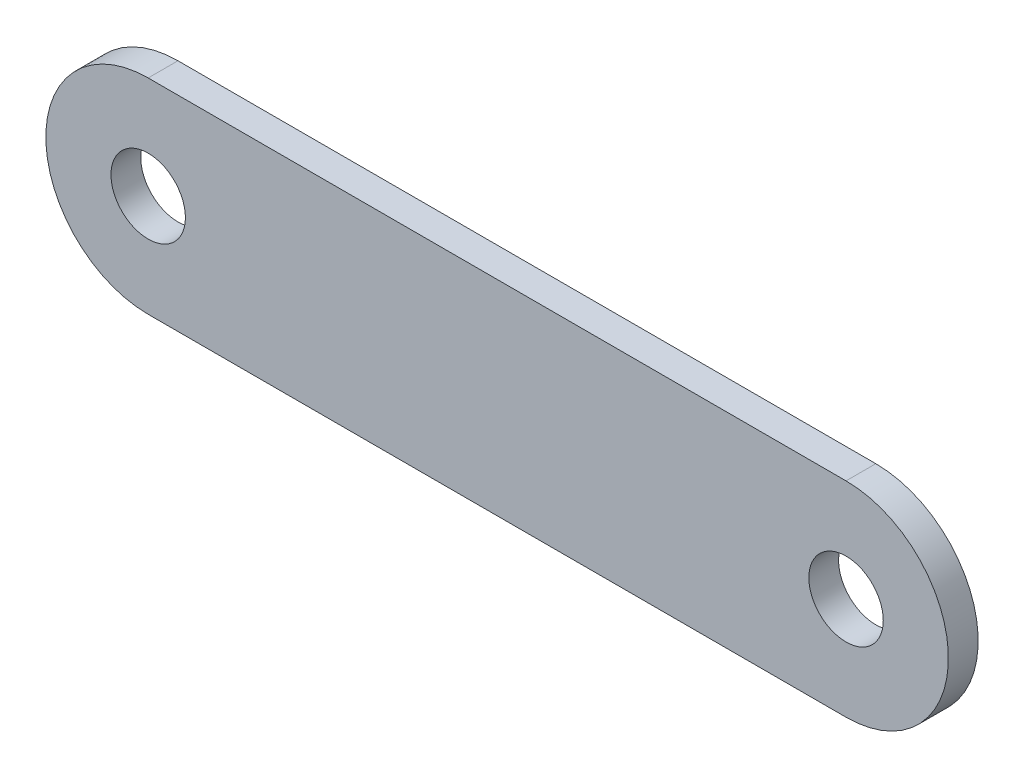
ISO-10303-21;
HEADER;
FILE_DESCRIPTION(('STEP AP214'),'2;1');
FILE_NAME('part.step','',(''),(''),'','','');
FILE_SCHEMA(('AUTOMOTIVE_DESIGN { 1 0 10303 214 1 1 1 1 }'));
ENDSEC;
DATA;
#1=APPLICATION_CONTEXT('core data for automotive mechanical design processes');
#2=APPLICATION_PROTOCOL_DEFINITION('international standard','automotive_design',2000,#1);
#3=PRODUCT_CONTEXT('',#1,'mechanical');
#4=PRODUCT('Part','Part','',(#3));
#5=PRODUCT_RELATED_PRODUCT_CATEGORY('part','',(#4));
#6=PRODUCT_DEFINITION_FORMATION('','',#4);
#7=PRODUCT_DEFINITION_CONTEXT('part definition',#1,'design');
#8=PRODUCT_DEFINITION('design','',#6,#7);
#9=PRODUCT_DEFINITION_SHAPE('','',#8);
#10=(LENGTH_UNIT() NAMED_UNIT(*) SI_UNIT(.MILLI.,.METRE.));
#11=(NAMED_UNIT(*) PLANE_ANGLE_UNIT() SI_UNIT($,.RADIAN.));
#12=(NAMED_UNIT(*) SI_UNIT($,.STERADIAN.) SOLID_ANGLE_UNIT());
#13=UNCERTAINTY_MEASURE_WITH_UNIT(LENGTH_MEASURE(1.E-05),#10,'distance_accuracy_value','');
#14=(GEOMETRIC_REPRESENTATION_CONTEXT(3) GLOBAL_UNCERTAINTY_ASSIGNED_CONTEXT((#13)) GLOBAL_UNIT_ASSIGNED_CONTEXT((#10,
#11,#12)) REPRESENTATION_CONTEXT('',''));
#15=CARTESIAN_POINT('',(0.,0.,0.));
#16=DIRECTION('',(0.,0.,1.));
#17=DIRECTION('',(1.,0.,0.));
#18=AXIS2_PLACEMENT_3D('',#15,#16,#17);
#19=CARTESIAN_POINT('',(0.,0.,3.19999999999965));
#20=DIRECTION('',(0.,0.,0.999999999999996));
#21=DIRECTION('',(1.,0.,0.));
#22=AXIS2_PLACEMENT_3D('',#19,#20,#21);
#23=PLANE('',#22);
#24=CARTESIAN_POINT('',(0.,0.,3.19999999999965));
#25=DIRECTION('',(0.,0.,0.999999999999996));
#26=DIRECTION('',(1.,0.,0.));
#27=AXIS2_PLACEMENT_3D('',#24,#25,#26);
#28=CIRCLE('',#27,4.);
#29=CARTESIAN_POINT('',(4.00000000000007,0.,3.19999999999965));
#30=VERTEX_POINT('',#29);
#31=EDGE_CURVE('E135',#30,#30,#28,.T.);
#32=ORIENTED_EDGE('',*,*,#31,.F.);
#33=EDGE_LOOP('',(#32));
#34=FACE_BOUND('',#33,.T.);
#35=CARTESIAN_POINT('',(0.,0.,3.19999999999965));
#36=DIRECTION('',(0.,0.,0.999999999999996));
#37=DIRECTION('',(1.,0.,0.));
#38=AXIS2_PLACEMENT_3D('',#35,#36,#37);
#39=CIRCLE('',#38,11.);
#40=CARTESIAN_POINT('',(0.,11.0000000000002,3.19999999999976));
#41=VERTEX_POINT('',#40);
#42=CARTESIAN_POINT('',(0.,-10.9999999999999,3.1999999999997));
#43=VERTEX_POINT('',#42);
#44=EDGE_CURVE('E114',#41,#43,#39,.T.);
#45=ORIENTED_EDGE('',*,*,#44,.T.);
#46=DIRECTION('',(1.,0.,0.));
#47=VECTOR('',#46,1.);
#48=CARTESIAN_POINT('',(0.,-10.9999999999999,3.1999999999997));
#49=LINE('',#48,#47);
#50=CARTESIAN_POINT('',(74.9999999999999,-10.9999999999996,3.19999999999954));
#51=VERTEX_POINT('',#50);
#52=EDGE_CURVE('E109',#43,#51,#49,.T.);
#53=ORIENTED_EDGE('',*,*,#52,.T.);
#54=CARTESIAN_POINT('',(75.0000000000001,1.59594559789866E-13,3.19999999999965));
#55=DIRECTION('',(0.,0.,0.999999999999996));
#56=DIRECTION('',(-1.,0.,0.));
#57=AXIS2_PLACEMENT_3D('',#54,#55,#56);
#58=CIRCLE('',#57,11.);
#59=CARTESIAN_POINT('',(75.0000000000003,11.0000000000003,3.1999999999997));
#60=VERTEX_POINT('',#59);
#61=EDGE_CURVE('E112',#51,#60,#58,.T.);
#62=ORIENTED_EDGE('',*,*,#61,.T.);
#63=DIRECTION('',(-1.,0.,0.));
#64=VECTOR('',#63,1.);
#65=CARTESIAN_POINT('',(0.,11.0000000000002,3.19999999999976));
#66=LINE('',#65,#64);
#67=EDGE_CURVE('E79',#60,#41,#66,.T.);
#68=ORIENTED_EDGE('',*,*,#67,.T.);
#69=EDGE_LOOP('',(#45,#53,#62,#68));
#70=FACE_BOUND('',#69,.T.);
#71=CARTESIAN_POINT('',(75.0000000000001,1.59594559789866E-13,3.19999999999965));
#72=DIRECTION('',(0.,0.,0.999999999999996));
#73=DIRECTION('',(1.,0.,0.));
#74=AXIS2_PLACEMENT_3D('',#71,#72,#73);
#75=CIRCLE('',#74,4.00000000000001);
#76=CARTESIAN_POINT('',(79.0000000000001,1.59594559789866E-13,3.19999999999965));
#77=VERTEX_POINT('',#76);
#78=EDGE_CURVE('E159',#77,#77,#75,.T.);
#79=ORIENTED_EDGE('',*,*,#78,.F.);
#80=EDGE_LOOP('',(#79));
#81=FACE_BOUND('',#80,.T.);
#82=ADVANCED_FACE('F61',(#34,#70,#81),#23,.T.);
#83=CARTESIAN_POINT('',(0.,0.,0.));
#84=DIRECTION('',(0.,0.,0.999999999999996));
#85=DIRECTION('',(1.,0.,0.));
#86=AXIS2_PLACEMENT_3D('',#83,#84,#85);
#87=PLANE('',#86);
#88=CARTESIAN_POINT('',(0.,0.,0.));
#89=DIRECTION('',(0.,0.,0.999999999999996));
#90=DIRECTION('',(1.,0.,0.));
#91=AXIS2_PLACEMENT_3D('',#88,#89,#90);
#92=CIRCLE('',#91,11.);
#93=CARTESIAN_POINT('',(1.11022302462516E-13,11.0000000000002,-1.11022302462516E-13));
#94=VERTEX_POINT('',#93);
#95=CARTESIAN_POINT('',(0.,-11.,0.));
#96=VERTEX_POINT('',#95);
#97=EDGE_CURVE('E131',#94,#96,#92,.T.);
#98=ORIENTED_EDGE('',*,*,#97,.F.);
#99=DIRECTION('',(-1.,0.,0.));
#100=VECTOR('',#99,1.);
#101=CARTESIAN_POINT('',(1.11022302462516E-13,11.0000000000002,-1.11022302462516E-13));
#102=LINE('',#101,#100);
#103=CARTESIAN_POINT('',(75.0000000000003,11.0000000000003,0.));
#104=VERTEX_POINT('',#103);
#105=EDGE_CURVE('E102',#104,#94,#102,.T.);
#106=ORIENTED_EDGE('',*,*,#105,.F.);
#107=CARTESIAN_POINT('',(75.0000000000002,1.73472347597681E-13,-2.22044604925031E-13));
#108=DIRECTION('',(0.,0.,0.999999999999996));
#109=DIRECTION('',(-1.,0.,0.));
#110=AXIS2_PLACEMENT_3D('',#107,#108,#109);
#111=CIRCLE('',#110,11.);
#112=CARTESIAN_POINT('',(75.,-10.9999999999996,0.));
#113=VERTEX_POINT('',#112);
#114=EDGE_CURVE('E96',#113,#104,#111,.T.);
#115=ORIENTED_EDGE('',*,*,#114,.F.);
#116=DIRECTION('',(1.,0.,0.));
#117=VECTOR('',#116,1.);
#118=CARTESIAN_POINT('',(0.,-11.,0.));
#119=LINE('',#118,#117);
#120=EDGE_CURVE('E119',#96,#113,#119,.T.);
#121=ORIENTED_EDGE('',*,*,#120,.F.);
#122=EDGE_LOOP('',(#98,#106,#115,#121));
#123=FACE_BOUND('',#122,.T.);
#124=CARTESIAN_POINT('',(0.,0.,0.));
#125=DIRECTION('',(0.,0.,0.999999999999996));
#126=DIRECTION('',(1.,0.,0.));
#127=AXIS2_PLACEMENT_3D('',#124,#125,#126);
#128=CIRCLE('',#127,4.);
#129=CARTESIAN_POINT('',(4.,0.,0.));
#130=VERTEX_POINT('',#129);
#131=EDGE_CURVE('E155',#130,#130,#128,.T.);
#132=ORIENTED_EDGE('',*,*,#131,.T.);
#133=EDGE_LOOP('',(#132));
#134=FACE_BOUND('',#133,.T.);
#135=CARTESIAN_POINT('',(75.0000000000002,1.73472347597681E-13,-2.22044604925031E-13));
#136=DIRECTION('',(0.,0.,0.999999999999996));
#137=DIRECTION('',(1.,0.,0.));
#138=AXIS2_PLACEMENT_3D('',#135,#136,#137);
#139=CIRCLE('',#138,4.00000000000001);
#140=CARTESIAN_POINT('',(79.0000000000002,1.73472347597681E-13,-2.22044604925031E-13));
#141=VERTEX_POINT('',#140);
#142=EDGE_CURVE('E163',#141,#141,#139,.T.);
#143=ORIENTED_EDGE('',*,*,#142,.T.);
#144=EDGE_LOOP('',(#143));
#145=FACE_BOUND('',#144,.T.);
#146=ADVANCED_FACE('F149',(#123,#134,#145),#87,.F.);
#147=CARTESIAN_POINT('',(0.,0.,3.19999999999965));
#148=DIRECTION('',(0.,0.,-0.999999999999996));
#149=DIRECTION('',(-1.,0.,0.));
#150=AXIS2_PLACEMENT_3D('',#147,#148,#149);
#151=CYLINDRICAL_SURFACE('',#150,11.);
#152=ORIENTED_EDGE('',*,*,#97,.T.);
#153=DIRECTION('',(0.,0.,-0.999999999999996));
#154=VECTOR('',#153,1.);
#155=CARTESIAN_POINT('',(0.,-10.9999999999999,3.1999999999997));
#156=LINE('',#155,#154);
#157=EDGE_CURVE('E13',#43,#96,#156,.T.);
#158=ORIENTED_EDGE('',*,*,#157,.F.);
#159=ORIENTED_EDGE('',*,*,#44,.F.);
#160=DIRECTION('',(0.,0.,-0.999999999999996));
#161=VECTOR('',#160,1.);
#162=CARTESIAN_POINT('',(0.,11.0000000000002,3.19999999999976));
#163=LINE('',#162,#161);
#164=EDGE_CURVE('E127',#41,#94,#163,.T.);
#165=ORIENTED_EDGE('',*,*,#164,.T.);
#166=EDGE_LOOP('',(#152,#158,#159,#165));
#167=FACE_BOUND('',#166,.T.);
#168=ADVANCED_FACE('F63',(#167),#151,.T.);
#169=CARTESIAN_POINT('',(0.,-10.9999999999999,3.1999999999997));
#170=DIRECTION('',(0.,1.,0.));
#171=DIRECTION('',(0.,0.,0.999999999999996));
#172=AXIS2_PLACEMENT_3D('',#169,#170,#171);
#173=PLANE('',#172);
#174=ORIENTED_EDGE('',*,*,#120,.T.);
#175=DIRECTION('',(0.,0.,-0.999999999999996));
#176=VECTOR('',#175,1.);
#177=CARTESIAN_POINT('',(74.9999999999999,-10.9999999999996,3.19999999999954));
#178=LINE('',#177,#176);
#179=EDGE_CURVE('E71',#51,#113,#178,.T.);
#180=ORIENTED_EDGE('',*,*,#179,.F.);
#181=ORIENTED_EDGE('',*,*,#52,.F.);
#182=ORIENTED_EDGE('',*,*,#157,.T.);
#183=EDGE_LOOP('',(#174,#180,#181,#182));
#184=FACE_BOUND('',#183,.T.);
#185=ADVANCED_FACE('F118',(#184),#173,.F.);
#186=CARTESIAN_POINT('',(75.0000000000001,1.59594559789866E-13,3.19999999999965));
#187=DIRECTION('',(0.,0.,-0.999999999999996));
#188=DIRECTION('',(-1.,0.,0.));
#189=AXIS2_PLACEMENT_3D('',#186,#187,#188);
#190=CYLINDRICAL_SURFACE('',#189,11.);
#191=ORIENTED_EDGE('',*,*,#114,.T.);
#192=DIRECTION('',(0.,0.,-0.999999999999996));
#193=VECTOR('',#192,1.);
#194=CARTESIAN_POINT('',(75.0000000000003,11.0000000000003,3.1999999999997));
#195=LINE('',#194,#193);
#196=EDGE_CURVE('E121',#60,#104,#195,.T.);
#197=ORIENTED_EDGE('',*,*,#196,.F.);
#198=ORIENTED_EDGE('',*,*,#61,.F.);
#199=ORIENTED_EDGE('',*,*,#179,.T.);
#200=EDGE_LOOP('',(#191,#197,#198,#199));
#201=FACE_BOUND('',#200,.T.);
#202=ADVANCED_FACE('F122',(#201),#190,.T.);
#203=CARTESIAN_POINT('',(0.,11.0000000000002,3.19999999999976));
#204=DIRECTION('',(0.,-1.,0.));
#205=DIRECTION('',(0.,0.,-0.999999999999996));
#206=AXIS2_PLACEMENT_3D('',#203,#204,#205);
#207=PLANE('',#206);
#208=ORIENTED_EDGE('',*,*,#105,.T.);
#209=ORIENTED_EDGE('',*,*,#164,.F.);
#210=ORIENTED_EDGE('',*,*,#67,.F.);
#211=ORIENTED_EDGE('',*,*,#196,.T.);
#212=EDGE_LOOP('',(#208,#209,#210,#211));
#213=FACE_BOUND('',#212,.T.);
#214=ADVANCED_FACE('F146',(#213),#207,.F.);
#215=CARTESIAN_POINT('',(0.,0.,3.19999999999965));
#216=DIRECTION('',(0.,0.,-0.999999999999996));
#217=DIRECTION('',(-1.,0.,0.));
#218=AXIS2_PLACEMENT_3D('',#215,#216,#217);
#219=CYLINDRICAL_SURFACE('',#218,4.);
#220=ORIENTED_EDGE('',*,*,#31,.T.);
#221=EDGE_LOOP('',(#220));
#222=FACE_BOUND('',#221,.T.);
#223=ORIENTED_EDGE('',*,*,#131,.F.);
#224=EDGE_LOOP('',(#223));
#225=FACE_BOUND('',#224,.T.);
#226=ADVANCED_FACE('F183',(#222,#225),#219,.F.);
#227=CARTESIAN_POINT('',(75.0000000000001,1.59594559789866E-13,3.19999999999965));
#228=DIRECTION('',(0.,0.,-0.999999999999996));
#229=DIRECTION('',(-1.,0.,0.));
#230=AXIS2_PLACEMENT_3D('',#227,#228,#229);
#231=CYLINDRICAL_SURFACE('',#230,4.00000000000001);
#232=ORIENTED_EDGE('',*,*,#78,.T.);
#233=EDGE_LOOP('',(#232));
#234=FACE_BOUND('',#233,.T.);
#235=ORIENTED_EDGE('',*,*,#142,.F.);
#236=EDGE_LOOP('',(#235));
#237=FACE_BOUND('',#236,.T.);
#238=ADVANCED_FACE('F172',(#234,#237),#231,.F.);
#239=CLOSED_SHELL('',(#82,#146,#168,#185,#202,#214,#226,#238));
#240=MANIFOLD_SOLID_BREP('B2',#239);
#241=ADVANCED_BREP_SHAPE_REPRESENTATION('',(#18,#240),#14);
#242=SHAPE_DEFINITION_REPRESENTATION(#9,#241);
ENDSEC;
END-ISO-10303-21;
